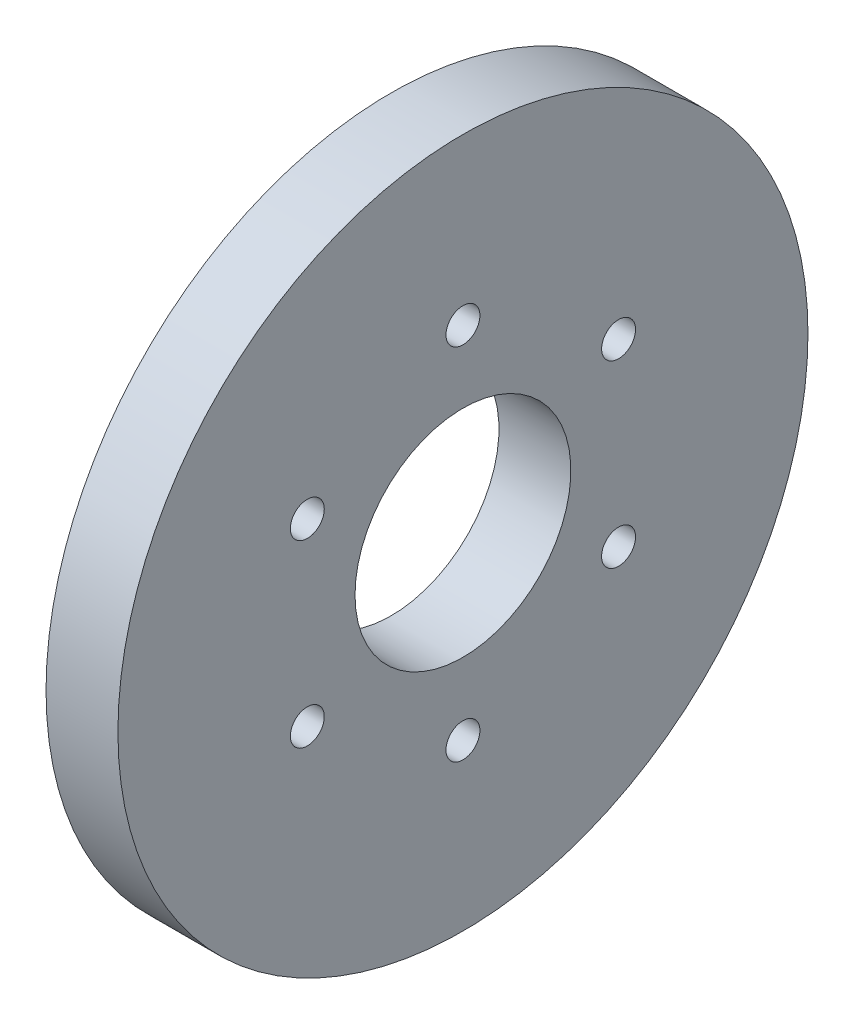
ISO-10303-21;
HEADER;
FILE_DESCRIPTION(('STEP AP214'),'2;1');
FILE_NAME('part.step','',(''),(''),'','','');
FILE_SCHEMA(('AUTOMOTIVE_DESIGN { 1 0 10303 214 1 1 1 1 }'));
ENDSEC;
DATA;
#1=APPLICATION_CONTEXT('core data for automotive mechanical design processes');
#2=APPLICATION_PROTOCOL_DEFINITION('international standard','automotive_design',2000,#1);
#3=PRODUCT_CONTEXT('',#1,'mechanical');
#4=PRODUCT('Part','Part','',(#3));
#5=PRODUCT_RELATED_PRODUCT_CATEGORY('part','',(#4));
#6=PRODUCT_DEFINITION_FORMATION('','',#4);
#7=PRODUCT_DEFINITION_CONTEXT('part definition',#1,'design');
#8=PRODUCT_DEFINITION('design','',#6,#7);
#9=PRODUCT_DEFINITION_SHAPE('','',#8);
#10=(LENGTH_UNIT() NAMED_UNIT(*) SI_UNIT(.MILLI.,.METRE.));
#11=(NAMED_UNIT(*) PLANE_ANGLE_UNIT() SI_UNIT($,.RADIAN.));
#12=(NAMED_UNIT(*) SI_UNIT($,.STERADIAN.) SOLID_ANGLE_UNIT());
#13=UNCERTAINTY_MEASURE_WITH_UNIT(LENGTH_MEASURE(1.E-05),#10,'distance_accuracy_value','');
#14=(GEOMETRIC_REPRESENTATION_CONTEXT(3) GLOBAL_UNCERTAINTY_ASSIGNED_CONTEXT((#13)) GLOBAL_UNIT_ASSIGNED_CONTEXT((#10,
#11,#12)) REPRESENTATION_CONTEXT('',''));
#15=CARTESIAN_POINT('',(0.,0.,0.));
#16=DIRECTION('',(0.,0.,1.));
#17=DIRECTION('',(1.,0.,0.));
#18=AXIS2_PLACEMENT_3D('',#15,#16,#17);
#19=CARTESIAN_POINT('',(9.525,0.,0.));
#20=DIRECTION('',(-1.,0.,0.));
#21=DIRECTION('',(0.,0.,1.));
#22=AXIS2_PLACEMENT_3D('',#19,#20,#21);
#23=CYLINDRICAL_SURFACE('',#22,45.72);
#24=CARTESIAN_POINT('',(9.525,0.,0.));
#25=DIRECTION('',(1.,0.,0.));
#26=DIRECTION('',(0.,0.,-1.));
#27=AXIS2_PLACEMENT_3D('',#24,#25,#26);
#28=CIRCLE('',#27,45.72);
#29=CARTESIAN_POINT('',(9.525,0.,-45.72));
#30=VERTEX_POINT('',#29);
#31=EDGE_CURVE('E10',#30,#30,#28,.T.);
#32=ORIENTED_EDGE('',*,*,#31,.F.);
#33=EDGE_LOOP('',(#32));
#34=FACE_BOUND('',#33,.T.);
#35=CARTESIAN_POINT('',(0.,0.,0.));
#36=DIRECTION('',(1.,0.,0.));
#37=DIRECTION('',(0.,0.,-1.));
#38=AXIS2_PLACEMENT_3D('',#35,#36,#37);
#39=CIRCLE('',#38,45.72);
#40=CARTESIAN_POINT('',(0.,0.,-45.72));
#41=VERTEX_POINT('',#40);
#42=EDGE_CURVE('E33',#41,#41,#39,.T.);
#43=ORIENTED_EDGE('',*,*,#42,.T.);
#44=EDGE_LOOP('',(#43));
#45=FACE_BOUND('',#44,.T.);
#46=ADVANCED_FACE('F30',(#34,#45),#23,.T.);
#47=CARTESIAN_POINT('',(9.525,0.,0.));
#48=DIRECTION('',(1.,0.,0.));
#49=DIRECTION('',(0.,0.,-1.));
#50=AXIS2_PLACEMENT_3D('',#47,#48,#49);
#51=PLANE('',#50);
#52=CARTESIAN_POINT('',(9.525,-11.9062500000001,-20.6222299276169));
#53=DIRECTION('',(-1.,0.,0.));
#54=DIRECTION('',(0.,0.866025403784436,-0.500000000000004));
#55=AXIS2_PLACEMENT_3D('',#52,#53,#54);
#56=CIRCLE('',#55,2.24789999999999);
#57=CARTESIAN_POINT('',(9.525,-9.95951149483307,-21.7461799276169));
#58=VERTEX_POINT('',#57);
#59=EDGE_CURVE('E76',#58,#58,#56,.T.);
#60=ORIENTED_EDGE('',*,*,#59,.T.);
#61=EDGE_LOOP('',(#60));
#62=FACE_BOUND('',#61,.T.);
#63=CARTESIAN_POINT('',(9.525,-23.8125,0.));
#64=DIRECTION('',(-1.,0.,0.));
#65=DIRECTION('',(0.,0.,-1.));
#66=AXIS2_PLACEMENT_3D('',#63,#64,#65);
#67=CIRCLE('',#66,2.24789999999999);
#68=CARTESIAN_POINT('',(9.525,-23.8125,-2.24789999999999));
#69=VERTEX_POINT('',#68);
#70=EDGE_CURVE('E70',#69,#69,#67,.T.);
#71=ORIENTED_EDGE('',*,*,#70,.T.);
#72=EDGE_LOOP('',(#71));
#73=FACE_BOUND('',#72,.T.);
#74=CARTESIAN_POINT('',(9.525,-11.9062499999998,20.6222299276171));
#75=DIRECTION('',(-1.,0.,0.));
#76=DIRECTION('',(0.,-0.866025403784443,-0.499999999999992));
#77=AXIS2_PLACEMENT_3D('',#74,#75,#76);
#78=CIRCLE('',#77,2.24789999999999);
#79=CARTESIAN_POINT('',(9.525,-13.8529885051669,19.4982799276171));
#80=VERTEX_POINT('',#79);
#81=EDGE_CURVE('E63',#80,#80,#78,.T.);
#82=ORIENTED_EDGE('',*,*,#81,.T.);
#83=EDGE_LOOP('',(#82));
#84=FACE_BOUND('',#83,.T.);
#85=CARTESIAN_POINT('',(9.525,11.9062500000002,20.6222299276168));
#86=DIRECTION('',(-1.,0.,0.));
#87=DIRECTION('',(0.,-0.866025403784433,0.50000000000001));
#88=AXIS2_PLACEMENT_3D('',#85,#86,#87);
#89=CIRCLE('',#88,2.24789999999999);
#90=CARTESIAN_POINT('',(9.525,9.95951149483322,21.7461799276168));
#91=VERTEX_POINT('',#90);
#92=EDGE_CURVE('E64',#91,#91,#89,.T.);
#93=ORIENTED_EDGE('',*,*,#92,.T.);
#94=EDGE_LOOP('',(#93));
#95=FACE_BOUND('',#94,.T.);
#96=CARTESIAN_POINT('',(9.525,11.90625,-20.622229927617));
#97=DIRECTION('',(-1.,0.,0.));
#98=DIRECTION('',(0.,0.86602540378444,0.499999999999998));
#99=AXIS2_PLACEMENT_3D('',#96,#97,#98);
#100=CIRCLE('',#99,2.24789999999999);
#101=CARTESIAN_POINT('',(9.525,13.852988505167,-19.498279927617));
#102=VERTEX_POINT('',#101);
#103=EDGE_CURVE('E56',#102,#102,#100,.T.);
#104=ORIENTED_EDGE('',*,*,#103,.T.);
#105=EDGE_LOOP('',(#104));
#106=FACE_BOUND('',#105,.T.);
#107=CARTESIAN_POINT('',(9.525,23.8125,0.));
#108=DIRECTION('',(-1.,0.,0.));
#109=DIRECTION('',(0.,0.,1.));
#110=AXIS2_PLACEMENT_3D('',#107,#108,#109);
#111=CIRCLE('',#110,2.24789999999999);
#112=CARTESIAN_POINT('',(9.525,23.8125,2.24789999999999));
#113=VERTEX_POINT('',#112);
#114=EDGE_CURVE('E45',#113,#113,#111,.T.);
#115=ORIENTED_EDGE('',*,*,#114,.T.);
#116=EDGE_LOOP('',(#115));
#117=FACE_BOUND('',#116,.T.);
#118=CARTESIAN_POINT('',(9.525,0.,0.));
#119=DIRECTION('',(-1.,0.,0.));
#120=DIRECTION('',(0.,0.,1.));
#121=AXIS2_PLACEMENT_3D('',#118,#119,#120);
#122=CIRCLE('',#121,14.3002);
#123=CARTESIAN_POINT('',(9.525,0.,14.3002));
#124=VERTEX_POINT('',#123);
#125=EDGE_CURVE('E40',#124,#124,#122,.T.);
#126=ORIENTED_EDGE('',*,*,#125,.T.);
#127=EDGE_LOOP('',(#126));
#128=FACE_BOUND('',#127,.T.);
#129=ORIENTED_EDGE('',*,*,#31,.T.);
#130=EDGE_LOOP('',(#129));
#131=FACE_BOUND('',#130,.T.);
#132=ADVANCED_FACE('F84',(#62,#73,#84,#95,#106,#117,#128,#131),#51,.T.);
#133=CARTESIAN_POINT('',(0.,0.,0.));
#134=DIRECTION('',(1.,0.,0.));
#135=DIRECTION('',(0.,0.,-1.));
#136=AXIS2_PLACEMENT_3D('',#133,#134,#135);
#137=PLANE('',#136);
#138=CARTESIAN_POINT('',(0.,-11.9062500000001,-20.6222299276169));
#139=DIRECTION('',(-1.,0.,0.));
#140=DIRECTION('',(0.,0.866025403784436,-0.500000000000004));
#141=AXIS2_PLACEMENT_3D('',#138,#139,#140);
#142=CIRCLE('',#141,2.2479);
#143=CARTESIAN_POINT('',(0.,-9.95951149483306,-21.7461799276169));
#144=VERTEX_POINT('',#143);
#145=EDGE_CURVE('E59',#144,#144,#142,.T.);
#146=ORIENTED_EDGE('',*,*,#145,.F.);
#147=EDGE_LOOP('',(#146));
#148=FACE_BOUND('',#147,.T.);
#149=CARTESIAN_POINT('',(0.,-23.8125,0.));
#150=DIRECTION('',(-1.,0.,0.));
#151=DIRECTION('',(0.,0.,-1.));
#152=AXIS2_PLACEMENT_3D('',#149,#150,#151);
#153=CIRCLE('',#152,2.2479);
#154=CARTESIAN_POINT('',(0.,-23.8125,-2.2479));
#155=VERTEX_POINT('',#154);
#156=EDGE_CURVE('E73',#155,#155,#153,.T.);
#157=ORIENTED_EDGE('',*,*,#156,.F.);
#158=EDGE_LOOP('',(#157));
#159=FACE_BOUND('',#158,.T.);
#160=CARTESIAN_POINT('',(0.,-11.9062499999998,20.6222299276171));
#161=DIRECTION('',(-1.,0.,0.));
#162=DIRECTION('',(0.,-0.866025403784443,-0.499999999999992));
#163=AXIS2_PLACEMENT_3D('',#160,#161,#162);
#164=CIRCLE('',#163,2.2479);
#165=CARTESIAN_POINT('',(0.,-13.8529885051669,19.4982799276171));
#166=VERTEX_POINT('',#165);
#167=EDGE_CURVE('E67',#166,#166,#164,.T.);
#168=ORIENTED_EDGE('',*,*,#167,.F.);
#169=EDGE_LOOP('',(#168));
#170=FACE_BOUND('',#169,.T.);
#171=CARTESIAN_POINT('',(0.,11.9062500000002,20.6222299276168));
#172=DIRECTION('',(-1.,0.,0.));
#173=DIRECTION('',(0.,-0.866025403784433,0.50000000000001));
#174=AXIS2_PLACEMENT_3D('',#171,#172,#173);
#175=CIRCLE('',#174,2.2479);
#176=CARTESIAN_POINT('',(0.,9.95951149483322,21.7461799276168));
#177=VERTEX_POINT('',#176);
#178=EDGE_CURVE('E60',#177,#177,#175,.T.);
#179=ORIENTED_EDGE('',*,*,#178,.F.);
#180=EDGE_LOOP('',(#179));
#181=FACE_BOUND('',#180,.T.);
#182=CARTESIAN_POINT('',(0.,11.90625,-20.622229927617));
#183=DIRECTION('',(-1.,0.,0.));
#184=DIRECTION('',(0.,0.86602540378444,0.499999999999998));
#185=AXIS2_PLACEMENT_3D('',#182,#183,#184);
#186=CIRCLE('',#185,2.2479);
#187=CARTESIAN_POINT('',(0.,13.852988505167,-19.498279927617));
#188=VERTEX_POINT('',#187);
#189=EDGE_CURVE('E53',#188,#188,#186,.T.);
#190=ORIENTED_EDGE('',*,*,#189,.F.);
#191=EDGE_LOOP('',(#190));
#192=FACE_BOUND('',#191,.T.);
#193=CARTESIAN_POINT('',(0.,23.8125,0.));
#194=DIRECTION('',(-1.,0.,0.));
#195=DIRECTION('',(0.,0.,1.));
#196=AXIS2_PLACEMENT_3D('',#193,#194,#195);
#197=CIRCLE('',#196,2.2479);
#198=CARTESIAN_POINT('',(0.,23.8125,2.2479));
#199=VERTEX_POINT('',#198);
#200=EDGE_CURVE('E50',#199,#199,#197,.T.);
#201=ORIENTED_EDGE('',*,*,#200,.F.);
#202=EDGE_LOOP('',(#201));
#203=FACE_BOUND('',#202,.T.);
#204=CARTESIAN_POINT('',(0.,0.,0.));
#205=DIRECTION('',(-1.,0.,0.));
#206=DIRECTION('',(0.,0.,1.));
#207=AXIS2_PLACEMENT_3D('',#204,#205,#206);
#208=CIRCLE('',#207,14.3002);
#209=CARTESIAN_POINT('',(0.,0.,14.3002));
#210=VERTEX_POINT('',#209);
#211=EDGE_CURVE('E42',#210,#210,#208,.T.);
#212=ORIENTED_EDGE('',*,*,#211,.F.);
#213=EDGE_LOOP('',(#212));
#214=FACE_BOUND('',#213,.T.);
#215=ORIENTED_EDGE('',*,*,#42,.F.);
#216=EDGE_LOOP('',(#215));
#217=FACE_BOUND('',#216,.T.);
#218=ADVANCED_FACE('F94',(#148,#159,#170,#181,#192,#203,#214,#217),#137,.F.);
#219=CARTESIAN_POINT('',(9.525,0.,0.));
#220=DIRECTION('',(-1.,0.,0.));
#221=DIRECTION('',(0.,0.,1.));
#222=AXIS2_PLACEMENT_3D('',#219,#220,#221);
#223=CYLINDRICAL_SURFACE('',#222,14.3002);
#224=ORIENTED_EDGE('',*,*,#125,.F.);
#225=EDGE_LOOP('',(#224));
#226=FACE_BOUND('',#225,.T.);
#227=ORIENTED_EDGE('',*,*,#211,.T.);
#228=EDGE_LOOP('',(#227));
#229=FACE_BOUND('',#228,.T.);
#230=ADVANCED_FACE('F97',(#226,#229),#223,.F.);
#231=CARTESIAN_POINT('',(0.,23.8125,0.));
#232=DIRECTION('',(-1.,0.,0.));
#233=DIRECTION('',(0.,0.,1.));
#234=AXIS2_PLACEMENT_3D('',#231,#232,#233);
#235=CYLINDRICAL_SURFACE('',#234,2.2479);
#236=ORIENTED_EDGE('',*,*,#114,.F.);
#237=EDGE_LOOP('',(#236));
#238=FACE_BOUND('',#237,.T.);
#239=ORIENTED_EDGE('',*,*,#200,.T.);
#240=EDGE_LOOP('',(#239));
#241=FACE_BOUND('',#240,.T.);
#242=ADVANCED_FACE('F123',(#238,#241),#235,.F.);
#243=CARTESIAN_POINT('',(0.,11.90625,-20.622229927617));
#244=DIRECTION('',(-1.,0.,0.));
#245=DIRECTION('',(0.,0.86602540378444,0.499999999999998));
#246=AXIS2_PLACEMENT_3D('',#243,#244,#245);
#247=CYLINDRICAL_SURFACE('',#246,2.2479);
#248=ORIENTED_EDGE('',*,*,#103,.F.);
#249=EDGE_LOOP('',(#248));
#250=FACE_BOUND('',#249,.T.);
#251=ORIENTED_EDGE('',*,*,#189,.T.);
#252=EDGE_LOOP('',(#251));
#253=FACE_BOUND('',#252,.T.);
#254=ADVANCED_FACE('F127',(#250,#253),#247,.F.);
#255=CARTESIAN_POINT('',(0.,11.9062500000002,20.6222299276168));
#256=DIRECTION('',(-1.,0.,0.));
#257=DIRECTION('',(0.,-0.866025403784433,0.50000000000001));
#258=AXIS2_PLACEMENT_3D('',#255,#256,#257);
#259=CYLINDRICAL_SURFACE('',#258,2.2479);
#260=ORIENTED_EDGE('',*,*,#92,.F.);
#261=EDGE_LOOP('',(#260));
#262=FACE_BOUND('',#261,.T.);
#263=ORIENTED_EDGE('',*,*,#178,.T.);
#264=EDGE_LOOP('',(#263));
#265=FACE_BOUND('',#264,.T.);
#266=ADVANCED_FACE('F131',(#262,#265),#259,.F.);
#267=CARTESIAN_POINT('',(0.,-11.9062499999998,20.6222299276171));
#268=DIRECTION('',(-1.,0.,0.));
#269=DIRECTION('',(0.,-0.866025403784443,-0.499999999999992));
#270=AXIS2_PLACEMENT_3D('',#267,#268,#269);
#271=CYLINDRICAL_SURFACE('',#270,2.2479);
#272=ORIENTED_EDGE('',*,*,#81,.F.);
#273=EDGE_LOOP('',(#272));
#274=FACE_BOUND('',#273,.T.);
#275=ORIENTED_EDGE('',*,*,#167,.T.);
#276=EDGE_LOOP('',(#275));
#277=FACE_BOUND('',#276,.T.);
#278=ADVANCED_FACE('F135',(#274,#277),#271,.F.);
#279=CARTESIAN_POINT('',(0.,-23.8125,0.));
#280=DIRECTION('',(-1.,0.,0.));
#281=DIRECTION('',(0.,0.,-1.));
#282=AXIS2_PLACEMENT_3D('',#279,#280,#281);
#283=CYLINDRICAL_SURFACE('',#282,2.2479);
#284=ORIENTED_EDGE('',*,*,#70,.F.);
#285=EDGE_LOOP('',(#284));
#286=FACE_BOUND('',#285,.T.);
#287=ORIENTED_EDGE('',*,*,#156,.T.);
#288=EDGE_LOOP('',(#287));
#289=FACE_BOUND('',#288,.T.);
#290=ADVANCED_FACE('F90',(#286,#289),#283,.F.);
#291=CARTESIAN_POINT('',(0.,-11.9062500000001,-20.6222299276169));
#292=DIRECTION('',(-1.,0.,0.));
#293=DIRECTION('',(0.,0.866025403784436,-0.500000000000004));
#294=AXIS2_PLACEMENT_3D('',#291,#292,#293);
#295=CYLINDRICAL_SURFACE('',#294,2.2479);
#296=ORIENTED_EDGE('',*,*,#59,.F.);
#297=EDGE_LOOP('',(#296));
#298=FACE_BOUND('',#297,.T.);
#299=ORIENTED_EDGE('',*,*,#145,.T.);
#300=EDGE_LOOP('',(#299));
#301=FACE_BOUND('',#300,.T.);
#302=ADVANCED_FACE('F87',(#298,#301),#295,.F.);
#303=CLOSED_SHELL('',(#46,#132,#218,#230,#242,#254,#266,#278,#290,#302));
#304=MANIFOLD_SOLID_BREP('B2',#303);
#305=ADVANCED_BREP_SHAPE_REPRESENTATION('',(#18,#304),#14);
#306=SHAPE_DEFINITION_REPRESENTATION(#9,#305);
ENDSEC;
END-ISO-10303-21;
